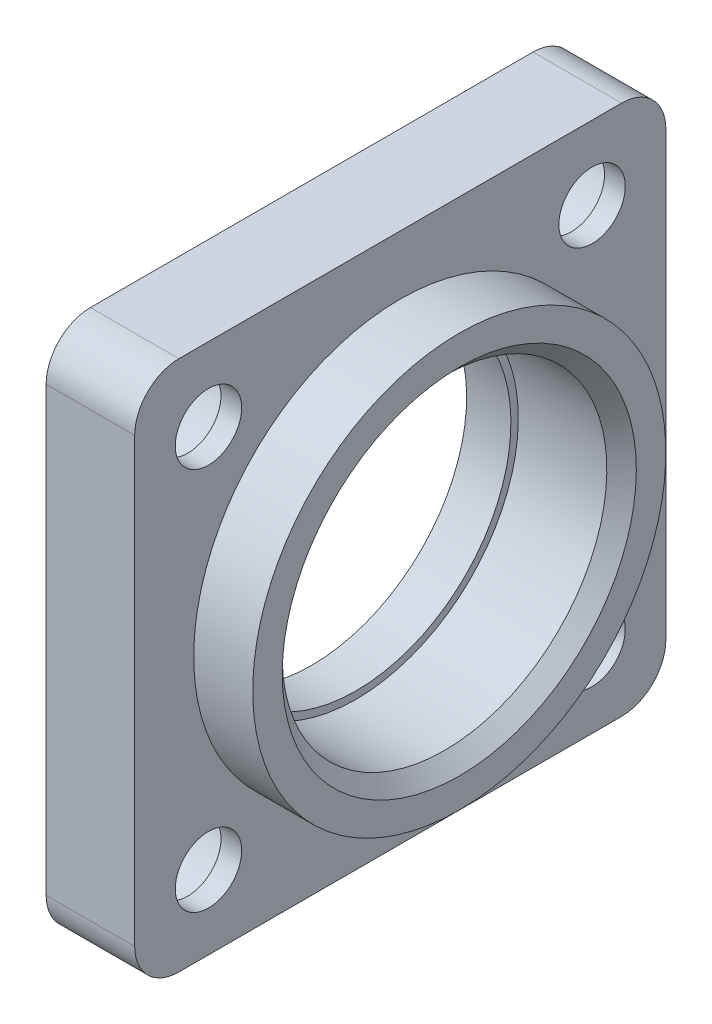
ISO-10303-21;
HEADER;
FILE_DESCRIPTION(('STEP AP214'),'2;1');
FILE_NAME('part.step','',(''),(''),'','','');
FILE_SCHEMA(('AUTOMOTIVE_DESIGN { 1 0 10303 214 1 1 1 1 }'));
ENDSEC;
DATA;
#1=APPLICATION_CONTEXT('core data for automotive mechanical design processes');
#2=APPLICATION_PROTOCOL_DEFINITION('international standard','automotive_design',2000,#1);
#3=PRODUCT_CONTEXT('',#1,'mechanical');
#4=PRODUCT('Part','Part','',(#3));
#5=PRODUCT_RELATED_PRODUCT_CATEGORY('part','',(#4));
#6=PRODUCT_DEFINITION_FORMATION('','',#4);
#7=PRODUCT_DEFINITION_CONTEXT('part definition',#1,'design');
#8=PRODUCT_DEFINITION('design','',#6,#7);
#9=PRODUCT_DEFINITION_SHAPE('','',#8);
#10=(LENGTH_UNIT() NAMED_UNIT(*) SI_UNIT(.MILLI.,.METRE.));
#11=(NAMED_UNIT(*) PLANE_ANGLE_UNIT() SI_UNIT($,.RADIAN.));
#12=(NAMED_UNIT(*) SI_UNIT($,.STERADIAN.) SOLID_ANGLE_UNIT());
#13=UNCERTAINTY_MEASURE_WITH_UNIT(LENGTH_MEASURE(1.E-05),#10,'distance_accuracy_value','');
#14=(GEOMETRIC_REPRESENTATION_CONTEXT(3) GLOBAL_UNCERTAINTY_ASSIGNED_CONTEXT((#13)) GLOBAL_UNIT_ASSIGNED_CONTEXT((#10,
#11,#12)) REPRESENTATION_CONTEXT('',''));
#15=CARTESIAN_POINT('',(0.,0.,0.));
#16=DIRECTION('',(0.,0.,1.));
#17=DIRECTION('',(1.,0.,0.));
#18=AXIS2_PLACEMENT_3D('',#15,#16,#17);
#19=CARTESIAN_POINT('',(-10.5411892688322,0.,0.));
#20=DIRECTION('',(-1.,0.,0.));
#21=DIRECTION('',(0.,-1.,0.));
#22=AXIS2_PLACEMENT_3D('',#19,#20,#21);
#23=CYLINDRICAL_SURFACE('',#22,11.);
#24=CARTESIAN_POINT('',(2.99999999999999,0.,0.));
#25=DIRECTION('',(-1.,0.,0.));
#26=DIRECTION('',(0.,-1.,0.));
#27=AXIS2_PLACEMENT_3D('',#24,#25,#26);
#28=CIRCLE('',#27,11.);
#29=CARTESIAN_POINT('',(2.99999999999999,-11.,0.));
#30=VERTEX_POINT('',#29);
#31=EDGE_CURVE('E14',#30,#30,#28,.F.);
#32=ORIENTED_EDGE('',*,*,#31,.T.);
#33=EDGE_LOOP('',(#32));
#34=FACE_BOUND('',#33,.T.);
#35=CARTESIAN_POINT('',(-3.,0.,0.));
#36=DIRECTION('',(-1.,0.,0.));
#37=DIRECTION('',(0.,-1.,0.));
#38=AXIS2_PLACEMENT_3D('',#35,#36,#37);
#39=CIRCLE('',#38,11.);
#40=CARTESIAN_POINT('',(-3.,-11.,0.));
#41=VERTEX_POINT('',#40);
#42=EDGE_CURVE('E180',#41,#41,#39,.T.);
#43=ORIENTED_EDGE('',*,*,#42,.T.);
#44=EDGE_LOOP('',(#43));
#45=FACE_BOUND('',#44,.T.);
#46=ADVANCED_FACE('F87',(#34,#45),#23,.F.);
#47=CARTESIAN_POINT('',(-3.,11.,0.));
#48=DIRECTION('',(-1.,0.,0.));
#49=DIRECTION('',(0.,-1.,0.));
#50=AXIS2_PLACEMENT_3D('',#47,#48,#49);
#51=PLANE('',#50);
#52=ORIENTED_EDGE('',*,*,#42,.F.);
#53=EDGE_LOOP('',(#52));
#54=FACE_BOUND('',#53,.T.);
#55=CARTESIAN_POINT('',(-3.,0.,0.));
#56=DIRECTION('',(-1.,0.,0.));
#57=DIRECTION('',(0.,-1.,0.));
#58=AXIS2_PLACEMENT_3D('',#55,#56,#57);
#59=CIRCLE('',#58,10.5);
#60=CARTESIAN_POINT('',(-3.,-10.5,0.));
#61=VERTEX_POINT('',#60);
#62=EDGE_CURVE('E185',#61,#61,#59,.T.);
#63=ORIENTED_EDGE('',*,*,#62,.T.);
#64=EDGE_LOOP('',(#63));
#65=FACE_BOUND('',#64,.T.);
#66=ADVANCED_FACE('F246',(#54,#65),#51,.F.);
#67=CARTESIAN_POINT('',(-10.5411892688322,0.,0.));
#68=DIRECTION('',(-1.,0.,0.));
#69=DIRECTION('',(0.,-1.,0.));
#70=AXIS2_PLACEMENT_3D('',#67,#68,#69);
#71=CYLINDRICAL_SURFACE('',#70,10.5);
#72=ORIENTED_EDGE('',*,*,#62,.F.);
#73=EDGE_LOOP('',(#72));
#74=FACE_BOUND('',#73,.T.);
#75=CARTESIAN_POINT('',(-6.,0.,0.));
#76=DIRECTION('',(-1.,0.,0.));
#77=DIRECTION('',(0.,-1.,0.));
#78=AXIS2_PLACEMENT_3D('',#75,#76,#77);
#79=CIRCLE('',#78,10.5);
#80=CARTESIAN_POINT('',(-6.,-10.5,0.));
#81=VERTEX_POINT('',#80);
#82=EDGE_CURVE('E307',#81,#81,#79,.T.);
#83=ORIENTED_EDGE('',*,*,#82,.T.);
#84=EDGE_LOOP('',(#83));
#85=FACE_BOUND('',#84,.T.);
#86=ADVANCED_FACE('F252',(#74,#85),#71,.F.);
#87=CARTESIAN_POINT('',(-6.,10.5,0.));
#88=DIRECTION('',(1.,0.,0.));
#89=DIRECTION('',(0.,1.,0.));
#90=AXIS2_PLACEMENT_3D('',#87,#88,#89);
#91=PLANE('',#90);
#92=CARTESIAN_POINT('',(-6.,13.,-13.));
#93=DIRECTION('',(-1.,0.,0.));
#94=DIRECTION('',(0.,0.,1.));
#95=AXIS2_PLACEMENT_3D('',#92,#93,#94);
#96=CIRCLE('',#95,3.99999999999999);
#97=CARTESIAN_POINT('',(-6.,13.,-9.));
#98=VERTEX_POINT('',#97);
#99=EDGE_CURVE('E390',#98,#98,#96,.T.);
#100=ORIENTED_EDGE('',*,*,#99,.F.);
#101=EDGE_LOOP('',(#100));
#102=FACE_BOUND('',#101,.T.);
#103=CARTESIAN_POINT('',(-6.,13.,13.));
#104=DIRECTION('',(-1.,0.,0.));
#105=DIRECTION('',(0.,0.,1.));
#106=AXIS2_PLACEMENT_3D('',#103,#104,#105);
#107=CIRCLE('',#106,3.99999999999999);
#108=CARTESIAN_POINT('',(-6.,13.,17.));
#109=VERTEX_POINT('',#108);
#110=EDGE_CURVE('E227',#109,#109,#107,.T.);
#111=ORIENTED_EDGE('',*,*,#110,.F.);
#112=EDGE_LOOP('',(#111));
#113=FACE_BOUND('',#112,.T.);
#114=CARTESIAN_POINT('',(-5.99999999999999,-13.,13.));
#115=DIRECTION('',(-1.,0.,0.));
#116=DIRECTION('',(0.,0.,1.));
#117=AXIS2_PLACEMENT_3D('',#114,#115,#116);
#118=CIRCLE('',#117,3.99999999999999);
#119=CARTESIAN_POINT('',(-5.99999999999999,-13.,17.));
#120=VERTEX_POINT('',#119);
#121=EDGE_CURVE('E223',#120,#120,#118,.T.);
#122=ORIENTED_EDGE('',*,*,#121,.F.);
#123=EDGE_LOOP('',(#122));
#124=FACE_BOUND('',#123,.T.);
#125=CARTESIAN_POINT('',(-5.99999999999999,-13.,-13.));
#126=DIRECTION('',(-1.,0.,0.));
#127=DIRECTION('',(0.,0.,1.));
#128=AXIS2_PLACEMENT_3D('',#125,#126,#127);
#129=CIRCLE('',#128,3.99999999999999);
#130=CARTESIAN_POINT('',(-5.99999999999999,-13.,-9.00000000000001));
#131=VERTEX_POINT('',#130);
#132=EDGE_CURVE('E218',#131,#131,#129,.T.);
#133=ORIENTED_EDGE('',*,*,#132,.F.);
#134=EDGE_LOOP('',(#133));
#135=FACE_BOUND('',#134,.T.);
#136=ORIENTED_EDGE('',*,*,#82,.F.);
#137=EDGE_LOOP('',(#136));
#138=FACE_BOUND('',#137,.T.);
#139=DIRECTION('',(0.,0.,1.));
#140=VECTOR('',#139,1.);
#141=CARTESIAN_POINT('',(-5.99999999999999,-18.,0.));
#142=LINE('',#141,#140);
#143=CARTESIAN_POINT('',(-5.99999999999999,-18.,-15.));
#144=VERTEX_POINT('',#143);
#145=CARTESIAN_POINT('',(-5.99999999999999,-18.,15.));
#146=VERTEX_POINT('',#145);
#147=EDGE_CURVE('E157',#144,#146,#142,.T.);
#148=ORIENTED_EDGE('',*,*,#147,.T.);
#149=CARTESIAN_POINT('',(-5.99999999999999,-15.,15.));
#150=DIRECTION('',(1.,0.,0.));
#151=DIRECTION('',(0.,1.,0.));
#152=AXIS2_PLACEMENT_3D('',#149,#150,#151);
#153=CIRCLE('',#152,3.);
#154=CARTESIAN_POINT('',(-5.99999999999999,-15.,18.));
#155=VERTEX_POINT('',#154);
#156=EDGE_CURVE('E164',#146,#155,#153,.F.);
#157=ORIENTED_EDGE('',*,*,#156,.T.);
#158=DIRECTION('',(0.,1.,0.));
#159=VECTOR('',#158,1.);
#160=CARTESIAN_POINT('',(-6.,0.,18.));
#161=LINE('',#160,#159);
#162=CARTESIAN_POINT('',(-6.,15.,18.));
#163=VERTEX_POINT('',#162);
#164=EDGE_CURVE('E295',#155,#163,#161,.T.);
#165=ORIENTED_EDGE('',*,*,#164,.T.);
#166=CARTESIAN_POINT('',(-6.,15.,15.));
#167=DIRECTION('',(1.,0.,0.));
#168=DIRECTION('',(0.,1.,0.));
#169=AXIS2_PLACEMENT_3D('',#166,#167,#168);
#170=CIRCLE('',#169,3.);
#171=CARTESIAN_POINT('',(-6.,18.,15.));
#172=VERTEX_POINT('',#171);
#173=EDGE_CURVE('E182',#163,#172,#170,.F.);
#174=ORIENTED_EDGE('',*,*,#173,.T.);
#175=DIRECTION('',(0.,0.,1.));
#176=VECTOR('',#175,1.);
#177=CARTESIAN_POINT('',(-6.,18.,0.));
#178=LINE('',#177,#176);
#179=CARTESIAN_POINT('',(-6.,18.,-15.));
#180=VERTEX_POINT('',#179);
#181=EDGE_CURVE('E291',#180,#172,#178,.T.);
#182=ORIENTED_EDGE('',*,*,#181,.F.);
#183=CARTESIAN_POINT('',(-6.,15.,-15.));
#184=DIRECTION('',(1.,0.,0.));
#185=DIRECTION('',(0.,1.,0.));
#186=AXIS2_PLACEMENT_3D('',#183,#184,#185);
#187=CIRCLE('',#186,3.);
#188=CARTESIAN_POINT('',(-6.,15.,-18.));
#189=VERTEX_POINT('',#188);
#190=EDGE_CURVE('E165',#180,#189,#187,.F.);
#191=ORIENTED_EDGE('',*,*,#190,.T.);
#192=DIRECTION('',(0.,1.,0.));
#193=VECTOR('',#192,1.);
#194=CARTESIAN_POINT('',(-6.,0.,-18.));
#195=LINE('',#194,#193);
#196=CARTESIAN_POINT('',(-5.99999999999999,-15.,-18.));
#197=VERTEX_POINT('',#196);
#198=EDGE_CURVE('E159',#197,#189,#195,.T.);
#199=ORIENTED_EDGE('',*,*,#198,.F.);
#200=CARTESIAN_POINT('',(-5.99999999999999,-15.,-15.));
#201=DIRECTION('',(1.,0.,0.));
#202=DIRECTION('',(0.,1.,0.));
#203=AXIS2_PLACEMENT_3D('',#200,#201,#202);
#204=CIRCLE('',#203,3.);
#205=EDGE_CURVE('E154',#197,#144,#204,.F.);
#206=ORIENTED_EDGE('',*,*,#205,.T.);
#207=EDGE_LOOP('',(#148,#157,#165,#174,#182,#191,#199,#206));
#208=FACE_BOUND('',#207,.T.);
#209=ADVANCED_FACE('F156',(#102,#113,#124,#135,#138,#208),#91,.F.);
#210=CARTESIAN_POINT('',(0.,18.,0.));
#211=DIRECTION('',(-1.,0.,0.));
#212=DIRECTION('',(0.,-1.,0.));
#213=AXIS2_PLACEMENT_3D('',#210,#211,#212);
#214=PLANE('',#213);
#215=CARTESIAN_POINT('',(0.,13.,-13.));
#216=DIRECTION('',(-1.,0.,0.));
#217=DIRECTION('',(0.,-1.,0.));
#218=AXIS2_PLACEMENT_3D('',#215,#216,#217);
#219=CIRCLE('',#218,2.25000000000001);
#220=CARTESIAN_POINT('',(0.,10.75,-13.));
#221=VERTEX_POINT('',#220);
#222=EDGE_CURVE('E225',#221,#221,#219,.T.);
#223=ORIENTED_EDGE('',*,*,#222,.T.);
#224=EDGE_LOOP('',(#223));
#225=FACE_BOUND('',#224,.T.);
#226=CARTESIAN_POINT('',(0.,13.,13.));
#227=DIRECTION('',(-1.,0.,0.));
#228=DIRECTION('',(0.,-1.,0.));
#229=AXIS2_PLACEMENT_3D('',#226,#227,#228);
#230=CIRCLE('',#229,2.25000000000001);
#231=CARTESIAN_POINT('',(0.,10.75,13.));
#232=VERTEX_POINT('',#231);
#233=EDGE_CURVE('E220',#232,#232,#230,.T.);
#234=ORIENTED_EDGE('',*,*,#233,.T.);
#235=EDGE_LOOP('',(#234));
#236=FACE_BOUND('',#235,.T.);
#237=CARTESIAN_POINT('',(0.,-13.,13.));
#238=DIRECTION('',(-1.,0.,0.));
#239=DIRECTION('',(0.,-1.,0.));
#240=AXIS2_PLACEMENT_3D('',#237,#238,#239);
#241=CIRCLE('',#240,2.25000000000001);
#242=CARTESIAN_POINT('',(0.,-15.25,13.));
#243=VERTEX_POINT('',#242);
#244=EDGE_CURVE('E215',#243,#243,#241,.T.);
#245=ORIENTED_EDGE('',*,*,#244,.T.);
#246=EDGE_LOOP('',(#245));
#247=FACE_BOUND('',#246,.T.);
#248=CARTESIAN_POINT('',(0.,-13.,-13.));
#249=DIRECTION('',(-1.,0.,0.));
#250=DIRECTION('',(0.,-1.,0.));
#251=AXIS2_PLACEMENT_3D('',#248,#249,#250);
#252=CIRCLE('',#251,2.25000000000001);
#253=CARTESIAN_POINT('',(0.,-15.25,-13.));
#254=VERTEX_POINT('',#253);
#255=EDGE_CURVE('E211',#254,#254,#252,.T.);
#256=ORIENTED_EDGE('',*,*,#255,.T.);
#257=EDGE_LOOP('',(#256));
#258=FACE_BOUND('',#257,.T.);
#259=DIRECTION('',(0.,1.,0.));
#260=VECTOR('',#259,1.);
#261=CARTESIAN_POINT('',(0.,0.,18.));
#262=LINE('',#261,#260);
#263=CARTESIAN_POINT('',(0.,-15.,18.));
#264=VERTEX_POINT('',#263);
#265=CARTESIAN_POINT('',(0.,15.,18.));
#266=VERTEX_POINT('',#265);
#267=EDGE_CURVE('E283',#264,#266,#262,.T.);
#268=ORIENTED_EDGE('',*,*,#267,.F.);
#269=CARTESIAN_POINT('',(0.,-15.,15.));
#270=DIRECTION('',(-1.,0.,0.));
#271=DIRECTION('',(0.,-1.,0.));
#272=AXIS2_PLACEMENT_3D('',#269,#270,#271);
#273=CIRCLE('',#272,3.);
#274=CARTESIAN_POINT('',(0.,-18.,15.));
#275=VERTEX_POINT('',#274);
#276=EDGE_CURVE('E201',#264,#275,#273,.F.);
#277=ORIENTED_EDGE('',*,*,#276,.T.);
#278=DIRECTION('',(0.,0.,1.));
#279=VECTOR('',#278,1.);
#280=CARTESIAN_POINT('',(0.,-18.,0.));
#281=LINE('',#280,#279);
#282=CARTESIAN_POINT('',(0.,-18.,-15.));
#283=VERTEX_POINT('',#282);
#284=EDGE_CURVE('E175',#283,#275,#281,.T.);
#285=ORIENTED_EDGE('',*,*,#284,.F.);
#286=CARTESIAN_POINT('',(0.,-15.,-15.));
#287=DIRECTION('',(-1.,0.,0.));
#288=DIRECTION('',(0.,-1.,0.));
#289=AXIS2_PLACEMENT_3D('',#286,#287,#288);
#290=CIRCLE('',#289,3.);
#291=CARTESIAN_POINT('',(0.,-15.,-18.));
#292=VERTEX_POINT('',#291);
#293=EDGE_CURVE('E179',#283,#292,#290,.F.);
#294=ORIENTED_EDGE('',*,*,#293,.T.);
#295=DIRECTION('',(0.,1.,0.));
#296=VECTOR('',#295,1.);
#297=CARTESIAN_POINT('',(0.,0.,-18.));
#298=LINE('',#297,#296);
#299=CARTESIAN_POINT('',(0.,15.,-18.));
#300=VERTEX_POINT('',#299);
#301=EDGE_CURVE('E298',#292,#300,#298,.T.);
#302=ORIENTED_EDGE('',*,*,#301,.T.);
#303=CARTESIAN_POINT('',(0.,15.,-15.));
#304=DIRECTION('',(-1.,0.,0.));
#305=DIRECTION('',(0.,-1.,0.));
#306=AXIS2_PLACEMENT_3D('',#303,#304,#305);
#307=CIRCLE('',#306,3.);
#308=CARTESIAN_POINT('',(0.,18.,-15.));
#309=VERTEX_POINT('',#308);
#310=EDGE_CURVE('E109',#300,#309,#307,.F.);
#311=ORIENTED_EDGE('',*,*,#310,.T.);
#312=DIRECTION('',(0.,0.,1.));
#313=VECTOR('',#312,1.);
#314=CARTESIAN_POINT('',(0.,18.,0.));
#315=LINE('',#314,#313);
#316=CARTESIAN_POINT('',(0.,18.,15.));
#317=VERTEX_POINT('',#316);
#318=EDGE_CURVE('E285',#309,#317,#315,.T.);
#319=ORIENTED_EDGE('',*,*,#318,.T.);
#320=CARTESIAN_POINT('',(0.,15.,15.));
#321=DIRECTION('',(-1.,0.,0.));
#322=DIRECTION('',(0.,-1.,0.));
#323=AXIS2_PLACEMENT_3D('',#320,#321,#322);
#324=CIRCLE('',#323,3.);
#325=EDGE_CURVE('E197',#317,#266,#324,.F.);
#326=ORIENTED_EDGE('',*,*,#325,.T.);
#327=EDGE_LOOP('',(#268,#277,#285,#294,#302,#311,#319,#326));
#328=FACE_BOUND('',#327,.T.);
#329=CARTESIAN_POINT('',(0.,0.,0.));
#330=DIRECTION('',(-1.,0.,0.));
#331=DIRECTION('',(0.,-1.,0.));
#332=AXIS2_PLACEMENT_3D('',#329,#330,#331);
#333=CIRCLE('',#332,14.);
#334=CARTESIAN_POINT('',(0.,-14.,0.));
#335=VERTEX_POINT('',#334);
#336=EDGE_CURVE('E304',#335,#335,#333,.T.);
#337=ORIENTED_EDGE('',*,*,#336,.T.);
#338=EDGE_LOOP('',(#337));
#339=FACE_BOUND('',#338,.T.);
#340=ADVANCED_FACE('F281',(#225,#236,#247,#258,#328,#339),#214,.F.);
#341=CARTESIAN_POINT('',(-10.5411892688322,0.,0.));
#342=DIRECTION('',(-1.,0.,0.));
#343=DIRECTION('',(0.,-1.,0.));
#344=AXIS2_PLACEMENT_3D('',#341,#342,#343);
#345=CYLINDRICAL_SURFACE('',#344,14.);
#346=ORIENTED_EDGE('',*,*,#336,.F.);
#347=EDGE_LOOP('',(#346));
#348=FACE_BOUND('',#347,.T.);
#349=CARTESIAN_POINT('',(4.,0.,0.));
#350=DIRECTION('',(-1.,0.,0.));
#351=DIRECTION('',(0.,-1.,0.));
#352=AXIS2_PLACEMENT_3D('',#349,#350,#351);
#353=CIRCLE('',#352,14.);
#354=CARTESIAN_POINT('',(4.00000000000001,-14.,0.));
#355=VERTEX_POINT('',#354);
#356=EDGE_CURVE('E293',#355,#355,#353,.T.);
#357=ORIENTED_EDGE('',*,*,#356,.T.);
#358=EDGE_LOOP('',(#357));
#359=FACE_BOUND('',#358,.T.);
#360=ADVANCED_FACE('F323',(#348,#359),#345,.T.);
#361=CARTESIAN_POINT('',(4.,14.,0.));
#362=DIRECTION('',(-1.,0.,0.));
#363=DIRECTION('',(0.,-1.,0.));
#364=AXIS2_PLACEMENT_3D('',#361,#362,#363);
#365=PLANE('',#364);
#366=CARTESIAN_POINT('',(4.,0.,0.));
#367=DIRECTION('',(-1.,0.,0.));
#368=DIRECTION('',(0.,-1.,0.));
#369=AXIS2_PLACEMENT_3D('',#366,#367,#368);
#370=CIRCLE('',#369,12.);
#371=CARTESIAN_POINT('',(4.,-12.,0.));
#372=VERTEX_POINT('',#371);
#373=EDGE_CURVE('E95',#372,#372,#370,.T.);
#374=ORIENTED_EDGE('',*,*,#373,.T.);
#375=EDGE_LOOP('',(#374));
#376=FACE_BOUND('',#375,.T.);
#377=ORIENTED_EDGE('',*,*,#356,.F.);
#378=EDGE_LOOP('',(#377));
#379=FACE_BOUND('',#378,.T.);
#380=ADVANCED_FACE('F232',(#376,#379),#365,.F.);
#381=CARTESIAN_POINT('',(0.,18.,0.));
#382=DIRECTION('',(0.,-1.,0.));
#383=DIRECTION('',(1.,0.,0.));
#384=AXIS2_PLACEMENT_3D('',#381,#382,#383);
#385=PLANE('',#384);
#386=ORIENTED_EDGE('',*,*,#318,.F.);
#387=DIRECTION('',(-1.,0.,0.));
#388=VECTOR('',#387,1.);
#389=CARTESIAN_POINT('',(0.,18.,-15.));
#390=LINE('',#389,#388);
#391=EDGE_CURVE('E208',#309,#180,#390,.T.);
#392=ORIENTED_EDGE('',*,*,#391,.T.);
#393=ORIENTED_EDGE('',*,*,#181,.T.);
#394=DIRECTION('',(-1.,0.,0.));
#395=VECTOR('',#394,1.);
#396=CARTESIAN_POINT('',(0.,18.,15.));
#397=LINE('',#396,#395);
#398=EDGE_CURVE('E102',#172,#317,#397,.F.);
#399=ORIENTED_EDGE('',*,*,#398,.T.);
#400=EDGE_LOOP('',(#386,#392,#393,#399));
#401=FACE_BOUND('',#400,.T.);
#402=ADVANCED_FACE('F334',(#401),#385,.F.);
#403=CARTESIAN_POINT('',(0.,0.,18.));
#404=DIRECTION('',(0.,0.,1.));
#405=DIRECTION('',(1.,0.,0.));
#406=AXIS2_PLACEMENT_3D('',#403,#404,#405);
#407=PLANE('',#406);
#408=ORIENTED_EDGE('',*,*,#164,.F.);
#409=DIRECTION('',(-1.,0.,0.));
#410=VECTOR('',#409,1.);
#411=CARTESIAN_POINT('',(0.,-15.,18.));
#412=LINE('',#411,#410);
#413=EDGE_CURVE('E195',#155,#264,#412,.F.);
#414=ORIENTED_EDGE('',*,*,#413,.T.);
#415=ORIENTED_EDGE('',*,*,#267,.T.);
#416=DIRECTION('',(-1.,0.,0.));
#417=VECTOR('',#416,1.);
#418=CARTESIAN_POINT('',(-6.,15.,18.));
#419=LINE('',#418,#417);
#420=EDGE_CURVE('E192',#266,#163,#419,.T.);
#421=ORIENTED_EDGE('',*,*,#420,.T.);
#422=EDGE_LOOP('',(#408,#414,#415,#421));
#423=FACE_BOUND('',#422,.T.);
#424=ADVANCED_FACE('F288',(#423),#407,.T.);
#425=CARTESIAN_POINT('',(0.,0.,-18.));
#426=DIRECTION('',(0.,0.,1.));
#427=DIRECTION('',(1.,0.,0.));
#428=AXIS2_PLACEMENT_3D('',#425,#426,#427);
#429=PLANE('',#428);
#430=ORIENTED_EDGE('',*,*,#301,.F.);
#431=DIRECTION('',(-1.,0.,0.));
#432=VECTOR('',#431,1.);
#433=CARTESIAN_POINT('',(-5.99999999999999,-15.,-18.));
#434=LINE('',#433,#432);
#435=EDGE_CURVE('E205',#292,#197,#434,.T.);
#436=ORIENTED_EDGE('',*,*,#435,.T.);
#437=ORIENTED_EDGE('',*,*,#198,.T.);
#438=DIRECTION('',(-1.,0.,0.));
#439=VECTOR('',#438,1.);
#440=CARTESIAN_POINT('',(0.,15.,-18.));
#441=LINE('',#440,#439);
#442=EDGE_CURVE('E203',#189,#300,#441,.F.);
#443=ORIENTED_EDGE('',*,*,#442,.T.);
#444=EDGE_LOOP('',(#430,#436,#437,#443));
#445=FACE_BOUND('',#444,.T.);
#446=ADVANCED_FACE('F337',(#445),#429,.F.);
#447=CARTESIAN_POINT('',(0.,-18.,0.));
#448=DIRECTION('',(0.,-1.,0.));
#449=DIRECTION('',(1.,0.,0.));
#450=AXIS2_PLACEMENT_3D('',#447,#448,#449);
#451=PLANE('',#450);
#452=ORIENTED_EDGE('',*,*,#284,.T.);
#453=DIRECTION('',(-1.,0.,0.));
#454=VECTOR('',#453,1.);
#455=CARTESIAN_POINT('',(0.,-18.,15.));
#456=LINE('',#455,#454);
#457=EDGE_CURVE('E174',#275,#146,#456,.T.);
#458=ORIENTED_EDGE('',*,*,#457,.T.);
#459=ORIENTED_EDGE('',*,*,#147,.F.);
#460=DIRECTION('',(-1.,0.,0.));
#461=VECTOR('',#460,1.);
#462=CARTESIAN_POINT('',(0.,-18.,-15.));
#463=LINE('',#462,#461);
#464=EDGE_CURVE('E171',#144,#283,#463,.F.);
#465=ORIENTED_EDGE('',*,*,#464,.T.);
#466=EDGE_LOOP('',(#452,#458,#459,#465));
#467=FACE_BOUND('',#466,.T.);
#468=ADVANCED_FACE('F170',(#467),#451,.T.);
#469=CARTESIAN_POINT('',(0.,-15.,15.));
#470=DIRECTION('',(-1.,0.,0.));
#471=DIRECTION('',(0.,-1.,0.));
#472=AXIS2_PLACEMENT_3D('',#469,#470,#471);
#473=CYLINDRICAL_SURFACE('',#472,3.);
#474=ORIENTED_EDGE('',*,*,#276,.F.);
#475=ORIENTED_EDGE('',*,*,#413,.F.);
#476=ORIENTED_EDGE('',*,*,#156,.F.);
#477=ORIENTED_EDGE('',*,*,#457,.F.);
#478=EDGE_LOOP('',(#474,#475,#476,#477));
#479=FACE_BOUND('',#478,.T.);
#480=ADVANCED_FACE('F258',(#479),#473,.T.);
#481=CARTESIAN_POINT('',(0.,-15.,-15.));
#482=DIRECTION('',(1.,0.,0.));
#483=DIRECTION('',(0.,1.,0.));
#484=AXIS2_PLACEMENT_3D('',#481,#482,#483);
#485=CYLINDRICAL_SURFACE('',#484,3.);
#486=ORIENTED_EDGE('',*,*,#293,.F.);
#487=ORIENTED_EDGE('',*,*,#464,.F.);
#488=ORIENTED_EDGE('',*,*,#205,.F.);
#489=ORIENTED_EDGE('',*,*,#435,.F.);
#490=EDGE_LOOP('',(#486,#487,#488,#489));
#491=FACE_BOUND('',#490,.T.);
#492=ADVANCED_FACE('F178',(#491),#485,.T.);
#493=CARTESIAN_POINT('',(0.,15.,-15.));
#494=DIRECTION('',(-1.,0.,0.));
#495=DIRECTION('',(0.,-1.,0.));
#496=AXIS2_PLACEMENT_3D('',#493,#494,#495);
#497=CYLINDRICAL_SURFACE('',#496,3.);
#498=ORIENTED_EDGE('',*,*,#310,.F.);
#499=ORIENTED_EDGE('',*,*,#442,.F.);
#500=ORIENTED_EDGE('',*,*,#190,.F.);
#501=ORIENTED_EDGE('',*,*,#391,.F.);
#502=EDGE_LOOP('',(#498,#499,#500,#501));
#503=FACE_BOUND('',#502,.T.);
#504=ADVANCED_FACE('F264',(#503),#497,.T.);
#505=CARTESIAN_POINT('',(0.,15.,15.));
#506=DIRECTION('',(1.,0.,0.));
#507=DIRECTION('',(0.,1.,0.));
#508=AXIS2_PLACEMENT_3D('',#505,#506,#507);
#509=CYLINDRICAL_SURFACE('',#508,3.);
#510=ORIENTED_EDGE('',*,*,#325,.F.);
#511=ORIENTED_EDGE('',*,*,#398,.F.);
#512=ORIENTED_EDGE('',*,*,#173,.F.);
#513=ORIENTED_EDGE('',*,*,#420,.F.);
#514=EDGE_LOOP('',(#510,#511,#512,#513));
#515=FACE_BOUND('',#514,.T.);
#516=ADVANCED_FACE('F266',(#515),#509,.T.);
#517=CARTESIAN_POINT('',(-5.99999999999999,-13.,-13.));
#518=DIRECTION('',(-1.,0.,0.));
#519=DIRECTION('',(0.,0.,1.));
#520=AXIS2_PLACEMENT_3D('',#517,#518,#519);
#521=CYLINDRICAL_SURFACE('',#520,2.25000000000001);
#522=CARTESIAN_POINT('',(-1.4,-13.,-13.));
#523=DIRECTION('',(-1.,0.,0.));
#524=DIRECTION('',(0.,0.,1.));
#525=AXIS2_PLACEMENT_3D('',#522,#523,#524);
#526=CIRCLE('',#525,2.25000000000001);
#527=CARTESIAN_POINT('',(-1.4,-13.,-10.75));
#528=VERTEX_POINT('',#527);
#529=EDGE_CURVE('E214',#528,#528,#526,.T.);
#530=ORIENTED_EDGE('',*,*,#529,.T.);
#531=EDGE_LOOP('',(#530));
#532=FACE_BOUND('',#531,.T.);
#533=ORIENTED_EDGE('',*,*,#255,.F.);
#534=EDGE_LOOP('',(#533));
#535=FACE_BOUND('',#534,.T.);
#536=ADVANCED_FACE('F269',(#532,#535),#521,.F.);
#537=CARTESIAN_POINT('',(-1.4,-10.75,-13.));
#538=DIRECTION('',(1.,0.,0.));
#539=DIRECTION('',(0.,0.,-1.));
#540=AXIS2_PLACEMENT_3D('',#537,#538,#539);
#541=PLANE('',#540);
#542=ORIENTED_EDGE('',*,*,#529,.F.);
#543=EDGE_LOOP('',(#542));
#544=FACE_BOUND('',#543,.T.);
#545=CARTESIAN_POINT('',(-1.4,-13.,-13.));
#546=DIRECTION('',(-1.,0.,0.));
#547=DIRECTION('',(0.,0.,1.));
#548=AXIS2_PLACEMENT_3D('',#545,#546,#547);
#549=CIRCLE('',#548,3.99999999999999);
#550=CARTESIAN_POINT('',(-1.4,-13.,-9.00000000000001));
#551=VERTEX_POINT('',#550);
#552=EDGE_CURVE('E412',#551,#551,#549,.T.);
#553=ORIENTED_EDGE('',*,*,#552,.T.);
#554=EDGE_LOOP('',(#553));
#555=FACE_BOUND('',#554,.T.);
#556=ADVANCED_FACE('F274',(#544,#555),#541,.F.);
#557=CARTESIAN_POINT('',(-5.99999999999999,-13.,-13.));
#558=DIRECTION('',(-1.,0.,0.));
#559=DIRECTION('',(0.,0.,1.));
#560=AXIS2_PLACEMENT_3D('',#557,#558,#559);
#561=CYLINDRICAL_SURFACE('',#560,3.99999999999999);
#562=ORIENTED_EDGE('',*,*,#552,.F.);
#563=EDGE_LOOP('',(#562));
#564=FACE_BOUND('',#563,.T.);
#565=ORIENTED_EDGE('',*,*,#132,.T.);
#566=EDGE_LOOP('',(#565));
#567=FACE_BOUND('',#566,.T.);
#568=ADVANCED_FACE('F347',(#564,#567),#561,.F.);
#569=CARTESIAN_POINT('',(-5.99999999999999,-13.,13.));
#570=DIRECTION('',(-1.,0.,0.));
#571=DIRECTION('',(0.,0.,1.));
#572=AXIS2_PLACEMENT_3D('',#569,#570,#571);
#573=CYLINDRICAL_SURFACE('',#572,2.25000000000001);
#574=CARTESIAN_POINT('',(-1.4,-13.,13.));
#575=DIRECTION('',(-1.,0.,0.));
#576=DIRECTION('',(0.,0.,1.));
#577=AXIS2_PLACEMENT_3D('',#574,#575,#576);
#578=CIRCLE('',#577,2.25000000000001);
#579=CARTESIAN_POINT('',(-1.4,-13.,15.25));
#580=VERTEX_POINT('',#579);
#581=EDGE_CURVE('E219',#580,#580,#578,.T.);
#582=ORIENTED_EDGE('',*,*,#581,.T.);
#583=EDGE_LOOP('',(#582));
#584=FACE_BOUND('',#583,.T.);
#585=ORIENTED_EDGE('',*,*,#244,.F.);
#586=EDGE_LOOP('',(#585));
#587=FACE_BOUND('',#586,.T.);
#588=ADVANCED_FACE('F351',(#584,#587),#573,.F.);
#589=CARTESIAN_POINT('',(-1.4,-10.75,13.));
#590=DIRECTION('',(1.,0.,0.));
#591=DIRECTION('',(0.,0.,-1.));
#592=AXIS2_PLACEMENT_3D('',#589,#590,#591);
#593=PLANE('',#592);
#594=ORIENTED_EDGE('',*,*,#581,.F.);
#595=EDGE_LOOP('',(#594));
#596=FACE_BOUND('',#595,.T.);
#597=CARTESIAN_POINT('',(-1.4,-13.,13.));
#598=DIRECTION('',(-1.,0.,0.));
#599=DIRECTION('',(0.,0.,1.));
#600=AXIS2_PLACEMENT_3D('',#597,#598,#599);
#601=CIRCLE('',#600,3.99999999999999);
#602=CARTESIAN_POINT('',(-1.4,-13.,17.));
#603=VERTEX_POINT('',#602);
#604=EDGE_CURVE('E405',#603,#603,#601,.T.);
#605=ORIENTED_EDGE('',*,*,#604,.T.);
#606=EDGE_LOOP('',(#605));
#607=FACE_BOUND('',#606,.T.);
#608=ADVANCED_FACE('F355',(#596,#607),#593,.F.);
#609=CARTESIAN_POINT('',(-5.99999999999999,-13.,13.));
#610=DIRECTION('',(-1.,0.,0.));
#611=DIRECTION('',(0.,0.,1.));
#612=AXIS2_PLACEMENT_3D('',#609,#610,#611);
#613=CYLINDRICAL_SURFACE('',#612,3.99999999999999);
#614=ORIENTED_EDGE('',*,*,#604,.F.);
#615=EDGE_LOOP('',(#614));
#616=FACE_BOUND('',#615,.T.);
#617=ORIENTED_EDGE('',*,*,#121,.T.);
#618=EDGE_LOOP('',(#617));
#619=FACE_BOUND('',#618,.T.);
#620=ADVANCED_FACE('F359',(#616,#619),#613,.F.);
#621=CARTESIAN_POINT('',(-6.,13.,13.));
#622=DIRECTION('',(-1.,0.,0.));
#623=DIRECTION('',(0.,0.,1.));
#624=AXIS2_PLACEMENT_3D('',#621,#622,#623);
#625=CYLINDRICAL_SURFACE('',#624,2.25000000000001);
#626=CARTESIAN_POINT('',(-1.4,13.,13.));
#627=DIRECTION('',(-1.,0.,0.));
#628=DIRECTION('',(0.,0.,1.));
#629=AXIS2_PLACEMENT_3D('',#626,#627,#628);
#630=CIRCLE('',#629,2.25000000000001);
#631=CARTESIAN_POINT('',(-1.4,13.,15.25));
#632=VERTEX_POINT('',#631);
#633=EDGE_CURVE('E224',#632,#632,#630,.T.);
#634=ORIENTED_EDGE('',*,*,#633,.T.);
#635=EDGE_LOOP('',(#634));
#636=FACE_BOUND('',#635,.T.);
#637=ORIENTED_EDGE('',*,*,#233,.F.);
#638=EDGE_LOOP('',(#637));
#639=FACE_BOUND('',#638,.T.);
#640=ADVANCED_FACE('F363',(#636,#639),#625,.F.);
#641=CARTESIAN_POINT('',(-1.4,15.25,13.));
#642=DIRECTION('',(1.,0.,0.));
#643=DIRECTION('',(0.,0.,-1.));
#644=AXIS2_PLACEMENT_3D('',#641,#642,#643);
#645=PLANE('',#644);
#646=ORIENTED_EDGE('',*,*,#633,.F.);
#647=EDGE_LOOP('',(#646));
#648=FACE_BOUND('',#647,.T.);
#649=CARTESIAN_POINT('',(-1.4,13.,13.));
#650=DIRECTION('',(-1.,0.,0.));
#651=DIRECTION('',(0.,0.,1.));
#652=AXIS2_PLACEMENT_3D('',#649,#650,#651);
#653=CIRCLE('',#652,3.99999999999999);
#654=CARTESIAN_POINT('',(-1.4,13.,17.));
#655=VERTEX_POINT('',#654);
#656=EDGE_CURVE('E398',#655,#655,#653,.T.);
#657=ORIENTED_EDGE('',*,*,#656,.T.);
#658=EDGE_LOOP('',(#657));
#659=FACE_BOUND('',#658,.T.);
#660=ADVANCED_FACE('F367',(#648,#659),#645,.F.);
#661=CARTESIAN_POINT('',(-6.,13.,13.));
#662=DIRECTION('',(-1.,0.,0.));
#663=DIRECTION('',(0.,0.,1.));
#664=AXIS2_PLACEMENT_3D('',#661,#662,#663);
#665=CYLINDRICAL_SURFACE('',#664,3.99999999999999);
#666=ORIENTED_EDGE('',*,*,#656,.F.);
#667=EDGE_LOOP('',(#666));
#668=FACE_BOUND('',#667,.T.);
#669=ORIENTED_EDGE('',*,*,#110,.T.);
#670=EDGE_LOOP('',(#669));
#671=FACE_BOUND('',#670,.T.);
#672=ADVANCED_FACE('F371',(#668,#671),#665,.F.);
#673=CARTESIAN_POINT('',(-6.,13.,-13.));
#674=DIRECTION('',(-1.,0.,0.));
#675=DIRECTION('',(0.,0.,1.));
#676=AXIS2_PLACEMENT_3D('',#673,#674,#675);
#677=CYLINDRICAL_SURFACE('',#676,2.25000000000001);
#678=CARTESIAN_POINT('',(-1.4,13.,-13.));
#679=DIRECTION('',(-1.,0.,0.));
#680=DIRECTION('',(0.,0.,1.));
#681=AXIS2_PLACEMENT_3D('',#678,#679,#680);
#682=CIRCLE('',#681,2.25000000000001);
#683=CARTESIAN_POINT('',(-1.4,13.,-10.75));
#684=VERTEX_POINT('',#683);
#685=EDGE_CURVE('E228',#684,#684,#682,.T.);
#686=ORIENTED_EDGE('',*,*,#685,.T.);
#687=EDGE_LOOP('',(#686));
#688=FACE_BOUND('',#687,.T.);
#689=ORIENTED_EDGE('',*,*,#222,.F.);
#690=EDGE_LOOP('',(#689));
#691=FACE_BOUND('',#690,.T.);
#692=ADVANCED_FACE('F375',(#688,#691),#677,.F.);
#693=CARTESIAN_POINT('',(-1.4,15.25,-13.));
#694=DIRECTION('',(1.,0.,0.));
#695=DIRECTION('',(0.,0.,-1.));
#696=AXIS2_PLACEMENT_3D('',#693,#694,#695);
#697=PLANE('',#696);
#698=ORIENTED_EDGE('',*,*,#685,.F.);
#699=EDGE_LOOP('',(#698));
#700=FACE_BOUND('',#699,.T.);
#701=CARTESIAN_POINT('',(-1.4,13.,-13.));
#702=DIRECTION('',(-1.,0.,0.));
#703=DIRECTION('',(0.,0.,1.));
#704=AXIS2_PLACEMENT_3D('',#701,#702,#703);
#705=CIRCLE('',#704,3.99999999999999);
#706=CARTESIAN_POINT('',(-1.4,13.,-9.));
#707=VERTEX_POINT('',#706);
#708=EDGE_CURVE('E389',#707,#707,#705,.T.);
#709=ORIENTED_EDGE('',*,*,#708,.T.);
#710=EDGE_LOOP('',(#709));
#711=FACE_BOUND('',#710,.T.);
#712=ADVANCED_FACE('F241',(#700,#711),#697,.F.);
#713=CARTESIAN_POINT('',(-6.,13.,-13.));
#714=DIRECTION('',(-1.,0.,0.));
#715=DIRECTION('',(0.,0.,1.));
#716=AXIS2_PLACEMENT_3D('',#713,#714,#715);
#717=CYLINDRICAL_SURFACE('',#716,3.99999999999999);
#718=ORIENTED_EDGE('',*,*,#708,.F.);
#719=EDGE_LOOP('',(#718));
#720=FACE_BOUND('',#719,.T.);
#721=ORIENTED_EDGE('',*,*,#99,.T.);
#722=EDGE_LOOP('',(#721));
#723=FACE_BOUND('',#722,.T.);
#724=ADVANCED_FACE('F236',(#720,#723),#717,.F.);
#725=CARTESIAN_POINT('',(4.,0.,0.));
#726=DIRECTION('',(1.,0.,0.));
#727=DIRECTION('',(0.,1.,0.));
#728=AXIS2_PLACEMENT_3D('',#725,#726,#727);
#729=CONICAL_SURFACE('',#728,12.,0.785398163397447);
#730=ORIENTED_EDGE('',*,*,#31,.F.);
#731=EDGE_LOOP('',(#730));
#732=FACE_BOUND('',#731,.T.);
#733=ORIENTED_EDGE('',*,*,#373,.F.);
#734=EDGE_LOOP('',(#733));
#735=FACE_BOUND('',#734,.T.);
#736=ADVANCED_FACE('F89',(#732,#735),#729,.F.);
#737=CLOSED_SHELL('',(#46,#66,#86,#209,#340,#360,#380,#402,#424,#446,#468,#480,#492,#504,#516,
#536,#556,#568,#588,#608,#620,#640,#660,#672,#692,#712,#724,#736));
#738=MANIFOLD_SOLID_BREP('B2',#737);
#739=ADVANCED_BREP_SHAPE_REPRESENTATION('',(#18,#738),#14);
#740=SHAPE_DEFINITION_REPRESENTATION(#9,#739);
ENDSEC;
END-ISO-10303-21;
